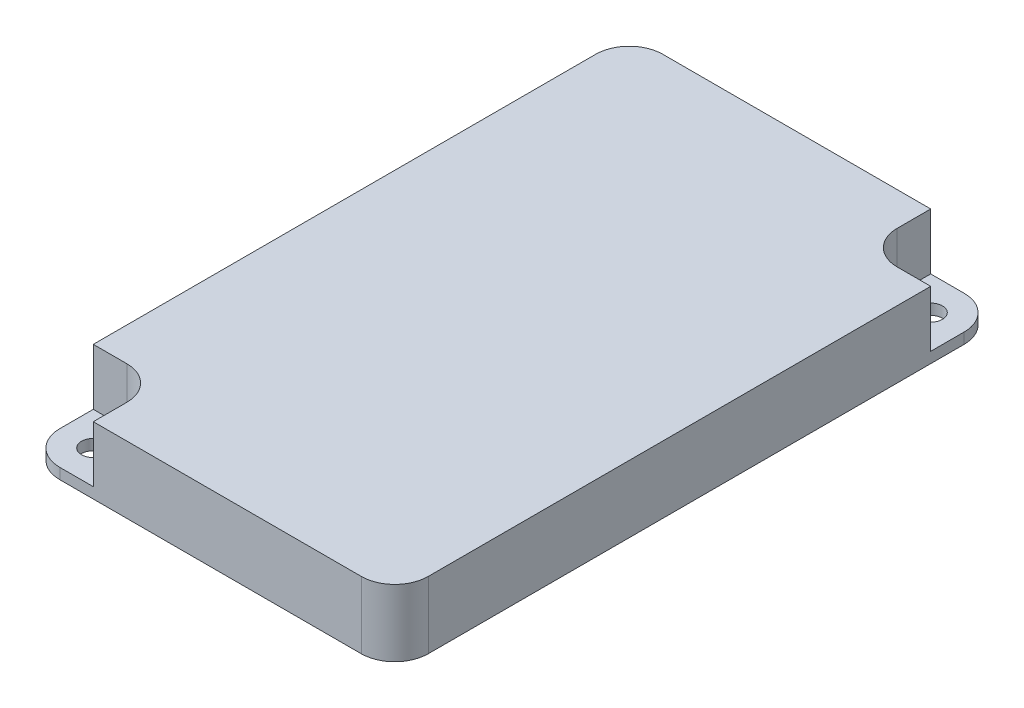
ISO-10303-21;
HEADER;
FILE_DESCRIPTION(('STEP AP214'),'2;1');
FILE_NAME('part.step','',(''),(''),'','','');
FILE_SCHEMA(('AUTOMOTIVE_DESIGN { 1 0 10303 214 1 1 1 1 }'));
ENDSEC;
DATA;
#1=APPLICATION_CONTEXT('core data for automotive mechanical design processes');
#2=APPLICATION_PROTOCOL_DEFINITION('international standard','automotive_design',2000,#1);
#3=PRODUCT_CONTEXT('',#1,'mechanical');
#4=PRODUCT('Part','Part','',(#3));
#5=PRODUCT_RELATED_PRODUCT_CATEGORY('part','',(#4));
#6=PRODUCT_DEFINITION_FORMATION('','',#4);
#7=PRODUCT_DEFINITION_CONTEXT('part definition',#1,'design');
#8=PRODUCT_DEFINITION('design','',#6,#7);
#9=PRODUCT_DEFINITION_SHAPE('','',#8);
#10=(LENGTH_UNIT() NAMED_UNIT(*) SI_UNIT(.MILLI.,.METRE.));
#11=(NAMED_UNIT(*) PLANE_ANGLE_UNIT() SI_UNIT($,.RADIAN.));
#12=(NAMED_UNIT(*) SI_UNIT($,.STERADIAN.) SOLID_ANGLE_UNIT());
#13=UNCERTAINTY_MEASURE_WITH_UNIT(LENGTH_MEASURE(1.E-05),#10,'distance_accuracy_value','');
#14=(GEOMETRIC_REPRESENTATION_CONTEXT(3) GLOBAL_UNCERTAINTY_ASSIGNED_CONTEXT((#13)) GLOBAL_UNIT_ASSIGNED_CONTEXT((#10,
#11,#12)) REPRESENTATION_CONTEXT('',''));
#15=CARTESIAN_POINT('',(0.,0.,0.));
#16=DIRECTION('',(0.,0.,1.));
#17=DIRECTION('',(1.,0.,0.));
#18=AXIS2_PLACEMENT_3D('',#15,#16,#17);
#19=CARTESIAN_POINT('',(-22.5,10.,-40.));
#20=DIRECTION('',(0.,-1.,0.));
#21=DIRECTION('',(0.,0.,-1.));
#22=AXIS2_PLACEMENT_3D('',#19,#20,#21);
#23=PLANE('',#22);
#24=DIRECTION('',(0.,0.,-1.));
#25=VECTOR('',#24,1.);
#26=CARTESIAN_POINT('',(17.5,10.,0.));
#27=LINE('',#26,#25);
#28=CARTESIAN_POINT('',(17.5,10.,-40.));
#29=VERTEX_POINT('',#28);
#30=CARTESIAN_POINT('',(17.5,10.,-45.));
#31=VERTEX_POINT('',#30);
#32=EDGE_CURVE('E154',#29,#31,#27,.T.);
#33=ORIENTED_EDGE('',*,*,#32,.T.);
#34=DIRECTION('',(-1.,0.,0.));
#35=VECTOR('',#34,1.);
#36=CARTESIAN_POINT('',(-22.5,10.,-45.));
#37=LINE('',#36,#35);
#38=CARTESIAN_POINT('',(-22.5,10.,-45.));
#39=VERTEX_POINT('',#38);
#40=EDGE_CURVE('E245',#31,#39,#37,.T.);
#41=ORIENTED_EDGE('',*,*,#40,.T.);
#42=CARTESIAN_POINT('',(-22.5,10.,-40.));
#43=DIRECTION('',(0.,1.,0.));
#44=DIRECTION('',(0.,0.,-1.));
#45=AXIS2_PLACEMENT_3D('',#42,#43,#44);
#46=CIRCLE('',#45,5.);
#47=CARTESIAN_POINT('',(-27.5,10.,-40.));
#48=VERTEX_POINT('',#47);
#49=EDGE_CURVE('E231',#39,#48,#46,.T.);
#50=ORIENTED_EDGE('',*,*,#49,.T.);
#51=DIRECTION('',(0.,0.,1.));
#52=VECTOR('',#51,1.);
#53=CARTESIAN_POINT('',(-27.5,10.,40.));
#54=LINE('',#53,#52);
#55=CARTESIAN_POINT('',(-27.5,10.,35.));
#56=VERTEX_POINT('',#55);
#57=EDGE_CURVE('E234',#48,#56,#54,.T.);
#58=ORIENTED_EDGE('',*,*,#57,.T.);
#59=DIRECTION('',(-1.,0.,0.));
#60=VECTOR('',#59,1.);
#61=CARTESIAN_POINT('',(0.,10.,35.));
#62=LINE('',#61,#60);
#63=CARTESIAN_POINT('',(-22.5,10.,35.));
#64=VERTEX_POINT('',#63);
#65=EDGE_CURVE('E197',#64,#56,#62,.T.);
#66=ORIENTED_EDGE('',*,*,#65,.F.);
#67=CARTESIAN_POINT('',(-22.5,10.,40.));
#68=DIRECTION('',(0.,1.,0.));
#69=DIRECTION('',(0.,0.,1.));
#70=AXIS2_PLACEMENT_3D('',#67,#68,#69);
#71=CIRCLE('',#70,5.);
#72=CARTESIAN_POINT('',(-17.5,10.,40.));
#73=VERTEX_POINT('',#72);
#74=EDGE_CURVE('E211',#73,#64,#71,.T.);
#75=ORIENTED_EDGE('',*,*,#74,.F.);
#76=DIRECTION('',(0.,0.,1.));
#77=VECTOR('',#76,1.);
#78=CARTESIAN_POINT('',(-17.5,10.,0.));
#79=LINE('',#78,#77);
#80=CARTESIAN_POINT('',(-17.5,10.,45.));
#81=VERTEX_POINT('',#80);
#82=EDGE_CURVE('E214',#73,#81,#79,.T.);
#83=ORIENTED_EDGE('',*,*,#82,.T.);
#84=DIRECTION('',(1.,0.,0.));
#85=VECTOR('',#84,1.);
#86=CARTESIAN_POINT('',(-22.5,10.,45.));
#87=LINE('',#86,#85);
#88=CARTESIAN_POINT('',(22.5,10.,45.));
#89=VERTEX_POINT('',#88);
#90=EDGE_CURVE('E238',#81,#89,#87,.T.);
#91=ORIENTED_EDGE('',*,*,#90,.T.);
#92=CARTESIAN_POINT('',(22.5,10.,40.));
#93=DIRECTION('',(0.,1.,0.));
#94=DIRECTION('',(0.,0.,1.));
#95=AXIS2_PLACEMENT_3D('',#92,#93,#94);
#96=CIRCLE('',#95,5.);
#97=CARTESIAN_POINT('',(27.5,10.,40.));
#98=VERTEX_POINT('',#97);
#99=EDGE_CURVE('E240',#89,#98,#96,.T.);
#100=ORIENTED_EDGE('',*,*,#99,.T.);
#101=DIRECTION('',(0.,0.,-1.));
#102=VECTOR('',#101,1.);
#103=CARTESIAN_POINT('',(27.5,10.,40.));
#104=LINE('',#103,#102);
#105=CARTESIAN_POINT('',(27.5,10.,-35.));
#106=VERTEX_POINT('',#105);
#107=EDGE_CURVE('E242',#98,#106,#104,.T.);
#108=ORIENTED_EDGE('',*,*,#107,.T.);
#109=DIRECTION('',(1.,0.,0.));
#110=VECTOR('',#109,1.);
#111=CARTESIAN_POINT('',(0.,10.,-35.));
#112=LINE('',#111,#110);
#113=CARTESIAN_POINT('',(22.5,10.,-35.));
#114=VERTEX_POINT('',#113);
#115=EDGE_CURVE('E169',#114,#106,#112,.T.);
#116=ORIENTED_EDGE('',*,*,#115,.F.);
#117=CARTESIAN_POINT('',(22.5,10.,-40.));
#118=DIRECTION('',(0.,1.,0.));
#119=DIRECTION('',(0.,0.,1.));
#120=AXIS2_PLACEMENT_3D('',#117,#118,#119);
#121=CIRCLE('',#120,5.);
#122=EDGE_CURVE('E184',#29,#114,#121,.T.);
#123=ORIENTED_EDGE('',*,*,#122,.F.);
#124=EDGE_LOOP('',(#33,#41,#50,#58,#66,#75,#83,#91,#100,#108,#116,#123));
#125=FACE_BOUND('',#124,.T.);
#126=ADVANCED_FACE('F35',(#125),#23,.F.);
#127=CARTESIAN_POINT('',(-22.5,10.,40.));
#128=DIRECTION('',(0.,-1.,0.));
#129=DIRECTION('',(0.,0.,-1.));
#130=AXIS2_PLACEMENT_3D('',#127,#128,#129);
#131=CYLINDRICAL_SURFACE('',#130,5.);
#132=CARTESIAN_POINT('',(-22.5,1.6,40.));
#133=DIRECTION('',(0.,1.,0.));
#134=DIRECTION('',(0.,0.,1.));
#135=AXIS2_PLACEMENT_3D('',#132,#133,#134);
#136=CIRCLE('',#135,5.);
#137=CARTESIAN_POINT('',(-27.5,1.6,40.));
#138=VERTEX_POINT('',#137);
#139=CARTESIAN_POINT('',(-22.5,1.6,45.));
#140=VERTEX_POINT('',#139);
#141=EDGE_CURVE('E50',#138,#140,#136,.T.);
#142=ORIENTED_EDGE('',*,*,#141,.F.);
#143=DIRECTION('',(0.,-1.,0.));
#144=VECTOR('',#143,1.);
#145=CARTESIAN_POINT('',(-27.5,10.,40.));
#146=LINE('',#145,#144);
#147=CARTESIAN_POINT('',(-27.5,0.,40.));
#148=VERTEX_POINT('',#147);
#149=EDGE_CURVE('E43',#138,#148,#146,.T.);
#150=ORIENTED_EDGE('',*,*,#149,.T.);
#151=CARTESIAN_POINT('',(-22.5,0.,40.));
#152=DIRECTION('',(0.,1.,0.));
#153=DIRECTION('',(0.,0.,-1.));
#154=AXIS2_PLACEMENT_3D('',#151,#152,#153);
#155=CIRCLE('',#154,5.);
#156=CARTESIAN_POINT('',(-22.5,0.,45.));
#157=VERTEX_POINT('',#156);
#158=EDGE_CURVE('E253',#148,#157,#155,.T.);
#159=ORIENTED_EDGE('',*,*,#158,.T.);
#160=DIRECTION('',(0.,-1.,0.));
#161=VECTOR('',#160,1.);
#162=CARTESIAN_POINT('',(-22.5,10.,45.));
#163=LINE('',#162,#161);
#164=EDGE_CURVE('E279',#140,#157,#163,.T.);
#165=ORIENTED_EDGE('',*,*,#164,.F.);
#166=EDGE_LOOP('',(#142,#150,#159,#165));
#167=FACE_BOUND('',#166,.T.);
#168=ADVANCED_FACE('F282',(#167),#131,.T.);
#169=CARTESIAN_POINT('',(-22.5,10.,45.));
#170=DIRECTION('',(0.,0.,-1.));
#171=DIRECTION('',(-1.,0.,0.));
#172=AXIS2_PLACEMENT_3D('',#169,#170,#171);
#173=PLANE('',#172);
#174=DIRECTION('',(0.,1.,0.));
#175=VECTOR('',#174,1.);
#176=CARTESIAN_POINT('',(-17.5,1.6,45.));
#177=LINE('',#176,#175);
#178=CARTESIAN_POINT('',(-17.5,1.6,45.));
#179=VERTEX_POINT('',#178);
#180=EDGE_CURVE('E210',#179,#81,#177,.T.);
#181=ORIENTED_EDGE('',*,*,#180,.F.);
#182=DIRECTION('',(1.,0.,0.));
#183=VECTOR('',#182,1.);
#184=CARTESIAN_POINT('',(0.,1.6,45.));
#185=LINE('',#184,#183);
#186=EDGE_CURVE('E199',#140,#179,#185,.T.);
#187=ORIENTED_EDGE('',*,*,#186,.F.);
#188=ORIENTED_EDGE('',*,*,#164,.T.);
#189=DIRECTION('',(1.,0.,0.));
#190=VECTOR('',#189,1.);
#191=CARTESIAN_POINT('',(-22.5,0.,45.));
#192=LINE('',#191,#190);
#193=CARTESIAN_POINT('',(22.5,0.,45.));
#194=VERTEX_POINT('',#193);
#195=EDGE_CURVE('E256',#157,#194,#192,.T.);
#196=ORIENTED_EDGE('',*,*,#195,.T.);
#197=DIRECTION('',(0.,-1.,0.));
#198=VECTOR('',#197,1.);
#199=CARTESIAN_POINT('',(22.5,10.,45.));
#200=LINE('',#199,#198);
#201=EDGE_CURVE('E276',#89,#194,#200,.T.);
#202=ORIENTED_EDGE('',*,*,#201,.F.);
#203=ORIENTED_EDGE('',*,*,#90,.F.);
#204=EDGE_LOOP('',(#181,#187,#188,#196,#202,#203));
#205=FACE_BOUND('',#204,.T.);
#206=ADVANCED_FACE('F299',(#205),#173,.F.);
#207=CARTESIAN_POINT('',(22.5,10.,-40.));
#208=DIRECTION('',(0.,-1.,0.));
#209=DIRECTION('',(0.,0.,-1.));
#210=AXIS2_PLACEMENT_3D('',#207,#208,#209);
#211=CYLINDRICAL_SURFACE('',#210,5.);
#212=CARTESIAN_POINT('',(22.5,1.6,-40.));
#213=DIRECTION('',(0.,1.,0.));
#214=DIRECTION('',(0.,0.,1.));
#215=AXIS2_PLACEMENT_3D('',#212,#213,#214);
#216=CIRCLE('',#215,5.);
#217=CARTESIAN_POINT('',(27.5,1.6,-40.));
#218=VERTEX_POINT('',#217);
#219=CARTESIAN_POINT('',(22.5,1.6,-45.));
#220=VERTEX_POINT('',#219);
#221=EDGE_CURVE('E58',#218,#220,#216,.T.);
#222=ORIENTED_EDGE('',*,*,#221,.F.);
#223=DIRECTION('',(0.,-1.,0.));
#224=VECTOR('',#223,1.);
#225=CARTESIAN_POINT('',(27.5,10.,-40.));
#226=LINE('',#225,#224);
#227=CARTESIAN_POINT('',(27.5,0.,-40.));
#228=VERTEX_POINT('',#227);
#229=EDGE_CURVE('E271',#218,#228,#226,.T.);
#230=ORIENTED_EDGE('',*,*,#229,.T.);
#231=CARTESIAN_POINT('',(22.5,0.,-40.));
#232=DIRECTION('',(0.,1.,0.));
#233=DIRECTION('',(0.,0.,-1.));
#234=AXIS2_PLACEMENT_3D('',#231,#232,#233);
#235=CIRCLE('',#234,5.);
#236=CARTESIAN_POINT('',(22.5,0.,-45.));
#237=VERTEX_POINT('',#236);
#238=EDGE_CURVE('E263',#228,#237,#235,.T.);
#239=ORIENTED_EDGE('',*,*,#238,.T.);
#240=DIRECTION('',(0.,-1.,0.));
#241=VECTOR('',#240,1.);
#242=CARTESIAN_POINT('',(22.5,10.,-45.));
#243=LINE('',#242,#241);
#244=EDGE_CURVE('E269',#220,#237,#243,.T.);
#245=ORIENTED_EDGE('',*,*,#244,.F.);
#246=EDGE_LOOP('',(#222,#230,#239,#245));
#247=FACE_BOUND('',#246,.T.);
#248=ADVANCED_FACE('F333',(#247),#211,.T.);
#249=CARTESIAN_POINT('',(-22.5,10.,-45.));
#250=DIRECTION('',(0.,0.,1.));
#251=DIRECTION('',(1.,0.,0.));
#252=AXIS2_PLACEMENT_3D('',#249,#250,#251);
#253=PLANE('',#252);
#254=DIRECTION('',(0.,1.,0.));
#255=VECTOR('',#254,1.);
#256=CARTESIAN_POINT('',(17.5,1.6,-45.));
#257=LINE('',#256,#255);
#258=CARTESIAN_POINT('',(17.5,1.6,-45.));
#259=VERTEX_POINT('',#258);
#260=EDGE_CURVE('E188',#259,#31,#257,.T.);
#261=ORIENTED_EDGE('',*,*,#260,.F.);
#262=DIRECTION('',(-1.,0.,0.));
#263=VECTOR('',#262,1.);
#264=CARTESIAN_POINT('',(0.,1.6,-45.));
#265=LINE('',#264,#263);
#266=EDGE_CURVE('E167',#220,#259,#265,.T.);
#267=ORIENTED_EDGE('',*,*,#266,.F.);
#268=ORIENTED_EDGE('',*,*,#244,.T.);
#269=DIRECTION('',(-1.,0.,0.));
#270=VECTOR('',#269,1.);
#271=CARTESIAN_POINT('',(-22.5,0.,-45.));
#272=LINE('',#271,#270);
#273=CARTESIAN_POINT('',(-22.5,0.,-45.));
#274=VERTEX_POINT('',#273);
#275=EDGE_CURVE('E235',#237,#274,#272,.T.);
#276=ORIENTED_EDGE('',*,*,#275,.T.);
#277=DIRECTION('',(0.,-1.,0.));
#278=VECTOR('',#277,1.);
#279=CARTESIAN_POINT('',(-22.5,10.,-45.));
#280=LINE('',#279,#278);
#281=EDGE_CURVE('E247',#39,#274,#280,.T.);
#282=ORIENTED_EDGE('',*,*,#281,.F.);
#283=ORIENTED_EDGE('',*,*,#40,.F.);
#284=EDGE_LOOP('',(#261,#267,#268,#276,#282,#283));
#285=FACE_BOUND('',#284,.T.);
#286=ADVANCED_FACE('F324',(#285),#253,.F.);
#287=CARTESIAN_POINT('',(-22.5,10.,40.));
#288=DIRECTION('',(0.,-1.,0.));
#289=DIRECTION('',(0.,0.,-1.));
#290=AXIS2_PLACEMENT_3D('',#287,#288,#289);
#291=CYLINDRICAL_SURFACE('',#290,1.75);
#292=CARTESIAN_POINT('',(-22.5,0.,40.));
#293=DIRECTION('',(0.,1.,0.));
#294=DIRECTION('',(0.,0.,1.));
#295=AXIS2_PLACEMENT_3D('',#292,#293,#294);
#296=CIRCLE('',#295,1.75);
#297=CARTESIAN_POINT('',(-22.5,0.,41.75));
#298=VERTEX_POINT('',#297);
#299=EDGE_CURVE('E227',#298,#298,#296,.T.);
#300=ORIENTED_EDGE('',*,*,#299,.F.);
#301=EDGE_LOOP('',(#300));
#302=FACE_BOUND('',#301,.T.);
#303=CARTESIAN_POINT('',(-22.5,1.6,40.));
#304=DIRECTION('',(0.,1.,0.));
#305=DIRECTION('',(0.,0.,1.));
#306=AXIS2_PLACEMENT_3D('',#303,#304,#305);
#307=CIRCLE('',#306,1.75);
#308=CARTESIAN_POINT('',(-22.5,1.6,41.75));
#309=VERTEX_POINT('',#308);
#310=EDGE_CURVE('E207',#309,#309,#307,.F.);
#311=ORIENTED_EDGE('',*,*,#310,.F.);
#312=EDGE_LOOP('',(#311));
#313=FACE_BOUND('',#312,.T.);
#314=ADVANCED_FACE('F321',(#302,#313),#291,.F.);
#315=CARTESIAN_POINT('',(22.5,10.,-40.));
#316=DIRECTION('',(0.,-1.,0.));
#317=DIRECTION('',(0.,0.,-1.));
#318=AXIS2_PLACEMENT_3D('',#315,#316,#317);
#319=CYLINDRICAL_SURFACE('',#318,1.75);
#320=CARTESIAN_POINT('',(22.5,0.,-40.));
#321=DIRECTION('',(0.,1.,0.));
#322=DIRECTION('',(0.,0.,1.));
#323=AXIS2_PLACEMENT_3D('',#320,#321,#322);
#324=CIRCLE('',#323,1.75);
#325=CARTESIAN_POINT('',(22.5,0.,-38.25));
#326=VERTEX_POINT('',#325);
#327=EDGE_CURVE('E190',#326,#326,#324,.T.);
#328=ORIENTED_EDGE('',*,*,#327,.F.);
#329=EDGE_LOOP('',(#328));
#330=FACE_BOUND('',#329,.T.);
#331=CARTESIAN_POINT('',(22.5,1.6,-40.));
#332=DIRECTION('',(0.,1.,0.));
#333=DIRECTION('',(0.,0.,1.));
#334=AXIS2_PLACEMENT_3D('',#331,#332,#333);
#335=CIRCLE('',#334,1.75);
#336=CARTESIAN_POINT('',(22.5,1.6,-38.25));
#337=VERTEX_POINT('',#336);
#338=EDGE_CURVE('E160',#337,#337,#335,.F.);
#339=ORIENTED_EDGE('',*,*,#338,.F.);
#340=EDGE_LOOP('',(#339));
#341=FACE_BOUND('',#340,.T.);
#342=ADVANCED_FACE('F323',(#330,#341),#319,.F.);
#343=CARTESIAN_POINT('',(-22.5,0.,-40.));
#344=DIRECTION('',(0.,-1.,0.));
#345=DIRECTION('',(0.,0.,-1.));
#346=AXIS2_PLACEMENT_3D('',#343,#344,#345);
#347=PLANE('',#346);
#348=ORIENTED_EDGE('',*,*,#299,.T.);
#349=EDGE_LOOP('',(#348));
#350=FACE_BOUND('',#349,.T.);
#351=CARTESIAN_POINT('',(-22.5,0.,-40.));
#352=DIRECTION('',(0.,1.,0.));
#353=DIRECTION('',(0.,0.,-1.));
#354=AXIS2_PLACEMENT_3D('',#351,#352,#353);
#355=CIRCLE('',#354,5.);
#356=CARTESIAN_POINT('',(-27.5,0.,-40.));
#357=VERTEX_POINT('',#356);
#358=EDGE_CURVE('E230',#274,#357,#355,.T.);
#359=ORIENTED_EDGE('',*,*,#358,.F.);
#360=ORIENTED_EDGE('',*,*,#275,.F.);
#361=ORIENTED_EDGE('',*,*,#238,.F.);
#362=DIRECTION('',(0.,0.,-1.));
#363=VECTOR('',#362,1.);
#364=CARTESIAN_POINT('',(27.5,0.,40.));
#365=LINE('',#364,#363);
#366=CARTESIAN_POINT('',(27.5,0.,40.));
#367=VERTEX_POINT('',#366);
#368=EDGE_CURVE('E260',#367,#228,#365,.T.);
#369=ORIENTED_EDGE('',*,*,#368,.F.);
#370=CARTESIAN_POINT('',(22.5,0.,40.));
#371=DIRECTION('',(0.,1.,0.));
#372=DIRECTION('',(0.,0.,1.));
#373=AXIS2_PLACEMENT_3D('',#370,#371,#372);
#374=CIRCLE('',#373,5.);
#375=EDGE_CURVE('E258',#194,#367,#374,.T.);
#376=ORIENTED_EDGE('',*,*,#375,.F.);
#377=ORIENTED_EDGE('',*,*,#195,.F.);
#378=ORIENTED_EDGE('',*,*,#158,.F.);
#379=DIRECTION('',(0.,0.,1.));
#380=VECTOR('',#379,1.);
#381=CARTESIAN_POINT('',(-27.5,0.,40.));
#382=LINE('',#381,#380);
#383=EDGE_CURVE('E250',#357,#148,#382,.T.);
#384=ORIENTED_EDGE('',*,*,#383,.F.);
#385=EDGE_LOOP('',(#359,#360,#361,#369,#376,#377,#378,#384));
#386=FACE_BOUND('',#385,.T.);
#387=ORIENTED_EDGE('',*,*,#327,.T.);
#388=EDGE_LOOP('',(#387));
#389=FACE_BOUND('',#388,.T.);
#390=ADVANCED_FACE('F292',(#350,#386,#389),#347,.T.);
#391=CARTESIAN_POINT('',(-22.5,10.,-40.));
#392=DIRECTION('',(0.,-1.,0.));
#393=DIRECTION('',(0.,0.,-1.));
#394=AXIS2_PLACEMENT_3D('',#391,#392,#393);
#395=CYLINDRICAL_SURFACE('',#394,5.);
#396=ORIENTED_EDGE('',*,*,#358,.T.);
#397=DIRECTION('',(0.,-1.,0.));
#398=VECTOR('',#397,1.);
#399=CARTESIAN_POINT('',(-27.5,10.,-40.));
#400=LINE('',#399,#398);
#401=EDGE_CURVE('E11',#48,#357,#400,.T.);
#402=ORIENTED_EDGE('',*,*,#401,.F.);
#403=ORIENTED_EDGE('',*,*,#49,.F.);
#404=ORIENTED_EDGE('',*,*,#281,.T.);
#405=EDGE_LOOP('',(#396,#402,#403,#404));
#406=FACE_BOUND('',#405,.T.);
#407=ADVANCED_FACE('F37',(#406),#395,.T.);
#408=CARTESIAN_POINT('',(-27.5,10.,40.));
#409=DIRECTION('',(1.,0.,0.));
#410=DIRECTION('',(0.,0.,-1.));
#411=AXIS2_PLACEMENT_3D('',#408,#409,#410);
#412=PLANE('',#411);
#413=DIRECTION('',(0.,0.,1.));
#414=VECTOR('',#413,1.);
#415=CARTESIAN_POINT('',(-27.5,1.6,0.));
#416=LINE('',#415,#414);
#417=CARTESIAN_POINT('',(-27.5,1.6,35.));
#418=VERTEX_POINT('',#417);
#419=EDGE_CURVE('E195',#418,#138,#416,.T.);
#420=ORIENTED_EDGE('',*,*,#419,.F.);
#421=DIRECTION('',(0.,1.,0.));
#422=VECTOR('',#421,1.);
#423=CARTESIAN_POINT('',(-27.5,1.6,35.));
#424=LINE('',#423,#422);
#425=EDGE_CURVE('E185',#418,#56,#424,.T.);
#426=ORIENTED_EDGE('',*,*,#425,.T.);
#427=ORIENTED_EDGE('',*,*,#57,.F.);
#428=ORIENTED_EDGE('',*,*,#401,.T.);
#429=ORIENTED_EDGE('',*,*,#383,.T.);
#430=ORIENTED_EDGE('',*,*,#149,.F.);
#431=EDGE_LOOP('',(#420,#426,#427,#428,#429,#430));
#432=FACE_BOUND('',#431,.T.);
#433=ADVANCED_FACE('F288',(#432),#412,.F.);
#434=CARTESIAN_POINT('',(22.5,10.,40.));
#435=DIRECTION('',(0.,-1.,0.));
#436=DIRECTION('',(0.,0.,-1.));
#437=AXIS2_PLACEMENT_3D('',#434,#435,#436);
#438=CYLINDRICAL_SURFACE('',#437,5.);
#439=ORIENTED_EDGE('',*,*,#375,.T.);
#440=DIRECTION('',(0.,-1.,0.));
#441=VECTOR('',#440,1.);
#442=CARTESIAN_POINT('',(27.5,10.,40.));
#443=LINE('',#442,#441);
#444=EDGE_CURVE('E273',#98,#367,#443,.T.);
#445=ORIENTED_EDGE('',*,*,#444,.F.);
#446=ORIENTED_EDGE('',*,*,#99,.F.);
#447=ORIENTED_EDGE('',*,*,#201,.T.);
#448=EDGE_LOOP('',(#439,#445,#446,#447));
#449=FACE_BOUND('',#448,.T.);
#450=ADVANCED_FACE('F303',(#449),#438,.T.);
#451=CARTESIAN_POINT('',(27.5,10.,40.));
#452=DIRECTION('',(-1.,0.,0.));
#453=DIRECTION('',(0.,0.,1.));
#454=AXIS2_PLACEMENT_3D('',#451,#452,#453);
#455=PLANE('',#454);
#456=DIRECTION('',(0.,0.,-1.));
#457=VECTOR('',#456,1.);
#458=CARTESIAN_POINT('',(27.5,1.6,0.));
#459=LINE('',#458,#457);
#460=CARTESIAN_POINT('',(27.5,1.6,-35.));
#461=VERTEX_POINT('',#460);
#462=EDGE_CURVE('E175',#461,#218,#459,.T.);
#463=ORIENTED_EDGE('',*,*,#462,.F.);
#464=DIRECTION('',(0.,1.,0.));
#465=VECTOR('',#464,1.);
#466=CARTESIAN_POINT('',(27.5,1.6,-35.));
#467=LINE('',#466,#465);
#468=EDGE_CURVE('E191',#461,#106,#467,.T.);
#469=ORIENTED_EDGE('',*,*,#468,.T.);
#470=ORIENTED_EDGE('',*,*,#107,.F.);
#471=ORIENTED_EDGE('',*,*,#444,.T.);
#472=ORIENTED_EDGE('',*,*,#368,.T.);
#473=ORIENTED_EDGE('',*,*,#229,.F.);
#474=EDGE_LOOP('',(#463,#469,#470,#471,#472,#473));
#475=FACE_BOUND('',#474,.T.);
#476=ADVANCED_FACE('F350',(#475),#455,.F.);
#477=CARTESIAN_POINT('',(17.5,1.6,0.));
#478=DIRECTION('',(1.,0.,0.));
#479=DIRECTION('',(0.,0.,-1.));
#480=AXIS2_PLACEMENT_3D('',#477,#478,#479);
#481=PLANE('',#480);
#482=ORIENTED_EDGE('',*,*,#32,.F.);
#483=DIRECTION('',(0.,1.,0.));
#484=VECTOR('',#483,1.);
#485=CARTESIAN_POINT('',(17.5,1.6,-40.));
#486=LINE('',#485,#484);
#487=CARTESIAN_POINT('',(17.5,1.6,-40.));
#488=VERTEX_POINT('',#487);
#489=EDGE_CURVE('E149',#488,#29,#486,.T.);
#490=ORIENTED_EDGE('',*,*,#489,.F.);
#491=DIRECTION('',(0.,0.,-1.));
#492=VECTOR('',#491,1.);
#493=CARTESIAN_POINT('',(17.5,1.6,0.));
#494=LINE('',#493,#492);
#495=EDGE_CURVE('E152',#488,#259,#494,.T.);
#496=ORIENTED_EDGE('',*,*,#495,.T.);
#497=ORIENTED_EDGE('',*,*,#260,.T.);
#498=EDGE_LOOP('',(#482,#490,#496,#497));
#499=FACE_BOUND('',#498,.T.);
#500=ADVANCED_FACE('F151',(#499),#481,.T.);
#501=CARTESIAN_POINT('',(0.,1.6,-35.));
#502=DIRECTION('',(0.,0.,1.));
#503=DIRECTION('',(1.,0.,0.));
#504=AXIS2_PLACEMENT_3D('',#501,#502,#503);
#505=PLANE('',#504);
#506=ORIENTED_EDGE('',*,*,#115,.T.);
#507=ORIENTED_EDGE('',*,*,#468,.F.);
#508=DIRECTION('',(1.,0.,0.));
#509=VECTOR('',#508,1.);
#510=CARTESIAN_POINT('',(0.,1.6,-35.));
#511=LINE('',#510,#509);
#512=CARTESIAN_POINT('',(22.5,1.6,-35.));
#513=VERTEX_POINT('',#512);
#514=EDGE_CURVE('E173',#513,#461,#511,.T.);
#515=ORIENTED_EDGE('',*,*,#514,.F.);
#516=DIRECTION('',(0.,1.,0.));
#517=VECTOR('',#516,1.);
#518=CARTESIAN_POINT('',(22.5,1.6,-35.));
#519=LINE('',#518,#517);
#520=EDGE_CURVE('E159',#513,#114,#519,.T.);
#521=ORIENTED_EDGE('',*,*,#520,.T.);
#522=EDGE_LOOP('',(#506,#507,#515,#521));
#523=FACE_BOUND('',#522,.T.);
#524=ADVANCED_FACE('F372',(#523),#505,.F.);
#525=CARTESIAN_POINT('',(22.5,1.6,-40.));
#526=DIRECTION('',(0.,1.,0.));
#527=DIRECTION('',(0.,0.,1.));
#528=AXIS2_PLACEMENT_3D('',#525,#526,#527);
#529=CYLINDRICAL_SURFACE('',#528,5.);
#530=ORIENTED_EDGE('',*,*,#122,.T.);
#531=ORIENTED_EDGE('',*,*,#520,.F.);
#532=EDGE_CURVE('E166',#488,#513,#216,.T.);
#533=ORIENTED_EDGE('',*,*,#532,.F.);
#534=ORIENTED_EDGE('',*,*,#489,.T.);
#535=EDGE_LOOP('',(#530,#531,#533,#534));
#536=FACE_BOUND('',#535,.T.);
#537=ADVANCED_FACE('F171',(#536),#529,.F.);
#538=CARTESIAN_POINT('',(0.,1.6,0.));
#539=DIRECTION('',(0.,1.,0.));
#540=DIRECTION('',(0.,0.,1.));
#541=AXIS2_PLACEMENT_3D('',#538,#539,#540);
#542=PLANE('',#541);
#543=ORIENTED_EDGE('',*,*,#495,.F.);
#544=ORIENTED_EDGE('',*,*,#532,.T.);
#545=ORIENTED_EDGE('',*,*,#514,.T.);
#546=ORIENTED_EDGE('',*,*,#462,.T.);
#547=ORIENTED_EDGE('',*,*,#221,.T.);
#548=ORIENTED_EDGE('',*,*,#266,.T.);
#549=EDGE_LOOP('',(#543,#544,#545,#546,#547,#548));
#550=FACE_BOUND('',#549,.T.);
#551=ORIENTED_EDGE('',*,*,#338,.T.);
#552=EDGE_LOOP('',(#551));
#553=FACE_BOUND('',#552,.T.);
#554=ADVANCED_FACE('F163',(#550,#553),#542,.T.);
#555=CARTESIAN_POINT('',(0.,1.6,35.));
#556=DIRECTION('',(0.,0.,-1.));
#557=DIRECTION('',(-1.,0.,0.));
#558=AXIS2_PLACEMENT_3D('',#555,#556,#557);
#559=PLANE('',#558);
#560=ORIENTED_EDGE('',*,*,#65,.T.);
#561=ORIENTED_EDGE('',*,*,#425,.F.);
#562=DIRECTION('',(-1.,0.,0.));
#563=VECTOR('',#562,1.);
#564=CARTESIAN_POINT('',(0.,1.6,35.));
#565=LINE('',#564,#563);
#566=CARTESIAN_POINT('',(-22.5,1.6,35.));
#567=VERTEX_POINT('',#566);
#568=EDGE_CURVE('E204',#567,#418,#565,.T.);
#569=ORIENTED_EDGE('',*,*,#568,.F.);
#570=DIRECTION('',(0.,1.,0.));
#571=VECTOR('',#570,1.);
#572=CARTESIAN_POINT('',(-22.5,1.6,35.));
#573=LINE('',#572,#571);
#574=EDGE_CURVE('E220',#567,#64,#573,.T.);
#575=ORIENTED_EDGE('',*,*,#574,.T.);
#576=EDGE_LOOP('',(#560,#561,#569,#575));
#577=FACE_BOUND('',#576,.T.);
#578=ADVANCED_FACE('F376',(#577),#559,.F.);
#579=CARTESIAN_POINT('',(-22.5,1.6,40.));
#580=DIRECTION('',(0.,1.,0.));
#581=DIRECTION('',(0.,0.,1.));
#582=AXIS2_PLACEMENT_3D('',#579,#580,#581);
#583=CYLINDRICAL_SURFACE('',#582,5.);
#584=ORIENTED_EDGE('',*,*,#74,.T.);
#585=ORIENTED_EDGE('',*,*,#574,.F.);
#586=CARTESIAN_POINT('',(-17.5,1.6,40.));
#587=VERTEX_POINT('',#586);
#588=EDGE_CURVE('E200',#587,#567,#136,.T.);
#589=ORIENTED_EDGE('',*,*,#588,.F.);
#590=DIRECTION('',(0.,1.,0.));
#591=VECTOR('',#590,1.);
#592=CARTESIAN_POINT('',(-17.5,1.6,40.));
#593=LINE('',#592,#591);
#594=EDGE_CURVE('E222',#587,#73,#593,.T.);
#595=ORIENTED_EDGE('',*,*,#594,.T.);
#596=EDGE_LOOP('',(#584,#585,#589,#595));
#597=FACE_BOUND('',#596,.T.);
#598=ADVANCED_FACE('F378',(#597),#583,.F.);
#599=CARTESIAN_POINT('',(-17.5,1.6,0.));
#600=DIRECTION('',(-1.,0.,0.));
#601=DIRECTION('',(0.,0.,1.));
#602=AXIS2_PLACEMENT_3D('',#599,#600,#601);
#603=PLANE('',#602);
#604=ORIENTED_EDGE('',*,*,#82,.F.);
#605=ORIENTED_EDGE('',*,*,#594,.F.);
#606=DIRECTION('',(0.,0.,1.));
#607=VECTOR('',#606,1.);
#608=CARTESIAN_POINT('',(-17.5,1.6,0.));
#609=LINE('',#608,#607);
#610=EDGE_CURVE('E202',#587,#179,#609,.T.);
#611=ORIENTED_EDGE('',*,*,#610,.T.);
#612=ORIENTED_EDGE('',*,*,#180,.T.);
#613=EDGE_LOOP('',(#604,#605,#611,#612));
#614=FACE_BOUND('',#613,.T.);
#615=ADVANCED_FACE('F311',(#614),#603,.T.);
#616=CARTESIAN_POINT('',(0.,1.6,0.));
#617=DIRECTION('',(0.,1.,0.));
#618=DIRECTION('',(0.,0.,1.));
#619=AXIS2_PLACEMENT_3D('',#616,#617,#618);
#620=PLANE('',#619);
#621=ORIENTED_EDGE('',*,*,#419,.T.);
#622=ORIENTED_EDGE('',*,*,#141,.T.);
#623=ORIENTED_EDGE('',*,*,#186,.T.);
#624=ORIENTED_EDGE('',*,*,#610,.F.);
#625=ORIENTED_EDGE('',*,*,#588,.T.);
#626=ORIENTED_EDGE('',*,*,#568,.T.);
#627=EDGE_LOOP('',(#621,#622,#623,#624,#625,#626));
#628=FACE_BOUND('',#627,.T.);
#629=ORIENTED_EDGE('',*,*,#310,.T.);
#630=EDGE_LOOP('',(#629));
#631=FACE_BOUND('',#630,.T.);
#632=ADVANCED_FACE('F315',(#628,#631),#620,.T.);
#633=CLOSED_SHELL('',(#126,#168,#206,#248,#286,#314,#342,#390,#407,#433,#450,#476,#500,#524,
#537,#554,#578,#598,#615,#632));
#634=MANIFOLD_SOLID_BREP('B2',#633);
#635=ADVANCED_BREP_SHAPE_REPRESENTATION('',(#18,#634),#14);
#636=SHAPE_DEFINITION_REPRESENTATION(#9,#635);
ENDSEC;
END-ISO-10303-21;
